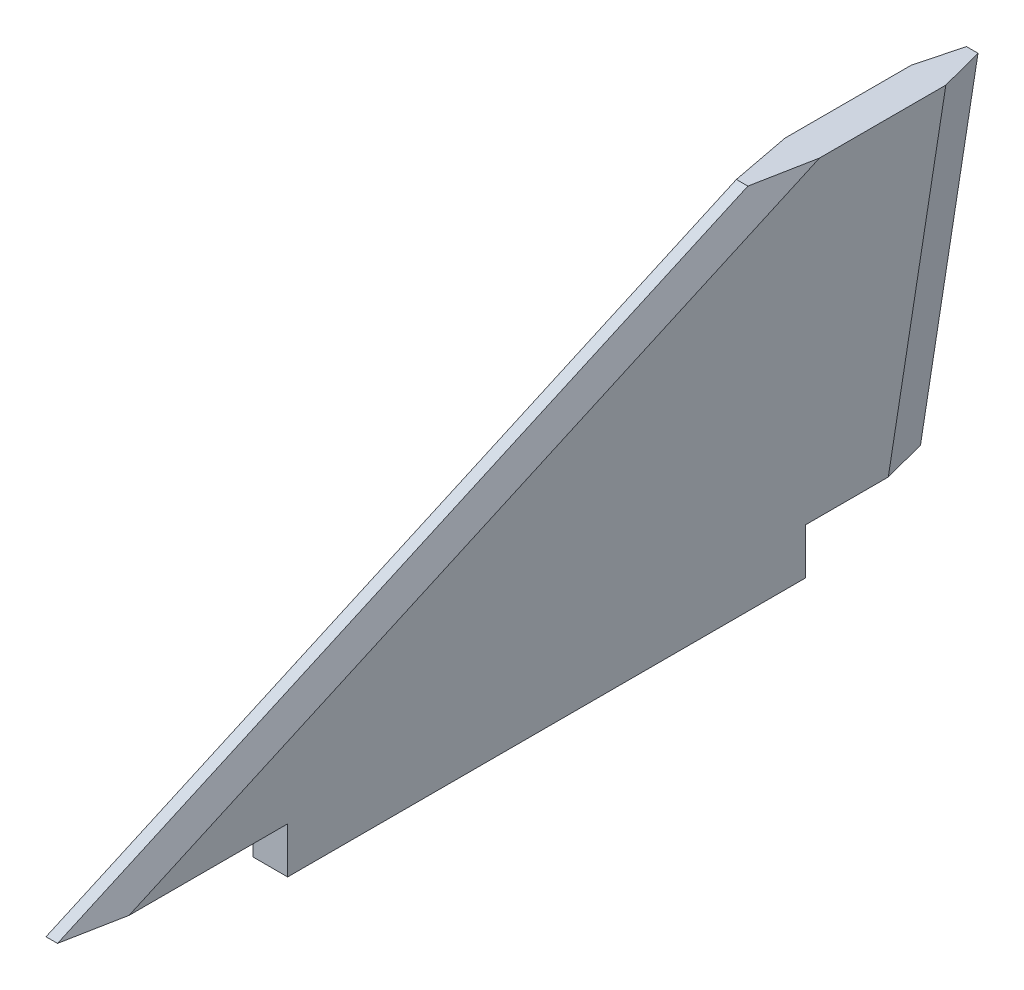
ISO-10303-21;
HEADER;
FILE_DESCRIPTION(('STEP AP214'),'2;1');
FILE_NAME('part.step','',(''),(''),'','','');
FILE_SCHEMA(('AUTOMOTIVE_DESIGN { 1 0 10303 214 1 1 1 1 }'));
ENDSEC;
DATA;
#1=APPLICATION_CONTEXT('core data for automotive mechanical design processes');
#2=APPLICATION_PROTOCOL_DEFINITION('international standard','automotive_design',2000,#1);
#3=PRODUCT_CONTEXT('',#1,'mechanical');
#4=PRODUCT('Part','Part','',(#3));
#5=PRODUCT_RELATED_PRODUCT_CATEGORY('part','',(#4));
#6=PRODUCT_DEFINITION_FORMATION('','',#4);
#7=PRODUCT_DEFINITION_CONTEXT('part definition',#1,'design');
#8=PRODUCT_DEFINITION('design','',#6,#7);
#9=PRODUCT_DEFINITION_SHAPE('','',#8);
#10=(LENGTH_UNIT() NAMED_UNIT(*) SI_UNIT(.MILLI.,.METRE.));
#11=(NAMED_UNIT(*) PLANE_ANGLE_UNIT() SI_UNIT($,.RADIAN.));
#12=(NAMED_UNIT(*) SI_UNIT($,.STERADIAN.) SOLID_ANGLE_UNIT());
#13=UNCERTAINTY_MEASURE_WITH_UNIT(LENGTH_MEASURE(1.E-05),#10,'distance_accuracy_value','');
#14=(GEOMETRIC_REPRESENTATION_CONTEXT(3) GLOBAL_UNCERTAINTY_ASSIGNED_CONTEXT((#13)) GLOBAL_UNIT_ASSIGNED_CONTEXT((#10,
#11,#12)) REPRESENTATION_CONTEXT('',''));
#15=CARTESIAN_POINT('',(0.,0.,0.));
#16=DIRECTION('',(0.,0.,1.));
#17=DIRECTION('',(1.,0.,0.));
#18=AXIS2_PLACEMENT_3D('',#15,#16,#17);
#19=CARTESIAN_POINT('',(1.5,0.,0.));
#20=DIRECTION('',(0.,-1.,0.));
#21=DIRECTION('',(0.,0.,-1.));
#22=AXIS2_PLACEMENT_3D('',#19,#20,#21);
#23=PLANE('',#22);
#24=DIRECTION('',(0.,0.,1.));
#25=VECTOR('',#24,1.);
#26=CARTESIAN_POINT('',(-1.5,0.,0.));
#27=LINE('',#26,#25);
#28=CARTESIAN_POINT('',(-1.5,0.,-45.));
#29=VERTEX_POINT('',#28);
#30=CARTESIAN_POINT('',(-1.5,0.,0.));
#31=VERTEX_POINT('',#30);
#32=EDGE_CURVE('E146',#29,#31,#27,.T.);
#33=ORIENTED_EDGE('',*,*,#32,.F.);
#34=DIRECTION('',(-1.,0.,0.));
#35=VECTOR('',#34,1.);
#36=CARTESIAN_POINT('',(1.5,0.,-45.));
#37=LINE('',#36,#35);
#38=CARTESIAN_POINT('',(1.5,0.,-45.));
#39=VERTEX_POINT('',#38);
#40=EDGE_CURVE('E141',#39,#29,#37,.T.);
#41=ORIENTED_EDGE('',*,*,#40,.F.);
#42=DIRECTION('',(0.,0.,1.));
#43=VECTOR('',#42,1.);
#44=CARTESIAN_POINT('',(1.5,0.,0.));
#45=LINE('',#44,#43);
#46=CARTESIAN_POINT('',(1.5,0.,0.));
#47=VERTEX_POINT('',#46);
#48=EDGE_CURVE('E143',#39,#47,#45,.T.);
#49=ORIENTED_EDGE('',*,*,#48,.T.);
#50=DIRECTION('',(-1.,0.,0.));
#51=VECTOR('',#50,1.);
#52=CARTESIAN_POINT('',(1.5,0.,0.));
#53=LINE('',#52,#51);
#54=EDGE_CURVE('E181',#47,#31,#53,.T.);
#55=ORIENTED_EDGE('',*,*,#54,.T.);
#56=EDGE_LOOP('',(#33,#41,#49,#55));
#57=FACE_BOUND('',#56,.T.);
#58=ADVANCED_FACE('F48',(#57),#23,.T.);
#59=CARTESIAN_POINT('',(1.5,0.,-45.));
#60=DIRECTION('',(0.,0.,-1.));
#61=DIRECTION('',(-1.,0.,0.));
#62=AXIS2_PLACEMENT_3D('',#59,#60,#61);
#63=PLANE('',#62);
#64=DIRECTION('',(0.,-1.,0.));
#65=VECTOR('',#64,1.);
#66=CARTESIAN_POINT('',(-1.5,0.,-45.));
#67=LINE('',#66,#65);
#68=CARTESIAN_POINT('',(-1.5,4.,-45.));
#69=VERTEX_POINT('',#68);
#70=EDGE_CURVE('E184',#69,#29,#67,.T.);
#71=ORIENTED_EDGE('',*,*,#70,.F.);
#72=DIRECTION('',(-1.,0.,0.));
#73=VECTOR('',#72,1.);
#74=CARTESIAN_POINT('',(1.5,4.,-45.));
#75=LINE('',#74,#73);
#76=CARTESIAN_POINT('',(1.5,4.,-45.));
#77=VERTEX_POINT('',#76);
#78=EDGE_CURVE('E153',#77,#69,#75,.T.);
#79=ORIENTED_EDGE('',*,*,#78,.F.);
#80=DIRECTION('',(0.,-1.,0.));
#81=VECTOR('',#80,1.);
#82=CARTESIAN_POINT('',(1.5,0.,-45.));
#83=LINE('',#82,#81);
#84=EDGE_CURVE('E158',#77,#39,#83,.T.);
#85=ORIENTED_EDGE('',*,*,#84,.T.);
#86=ORIENTED_EDGE('',*,*,#40,.T.);
#87=EDGE_LOOP('',(#71,#79,#85,#86));
#88=FACE_BOUND('',#87,.T.);
#89=ADVANCED_FACE('F165',(#88),#63,.T.);
#90=CARTESIAN_POINT('',(1.5,4.00000000000004,0.));
#91=DIRECTION('',(0.,-1.,0.));
#92=DIRECTION('',(0.,0.,-1.));
#93=AXIS2_PLACEMENT_3D('',#90,#91,#92);
#94=PLANE('',#93);
#95=DIRECTION('',(-1.,0.,0.));
#96=VECTOR('',#95,1.);
#97=CARTESIAN_POINT('',(1.5,3.99999999999999,-56.));
#98=LINE('',#97,#96);
#99=CARTESIAN_POINT('',(0.499999999999999,3.99999999999999,-56.));
#100=VERTEX_POINT('',#99);
#101=CARTESIAN_POINT('',(-0.499999999999998,3.99999999999999,-56.));
#102=VERTEX_POINT('',#101);
#103=EDGE_CURVE('E215',#100,#102,#98,.T.);
#104=ORIENTED_EDGE('',*,*,#103,.F.);
#105=DIRECTION('',(-0.254775202924953,0.,-0.967000308156388));
#106=VECTOR('',#105,1.);
#107=CARTESIAN_POINT('',(14.3615015894114,4.00000000000003,-3.38861492568621));
#108=LINE('',#107,#106);
#109=CARTESIAN_POINT('',(1.5,3.99999999999999,-52.2044959750607));
#110=VERTEX_POINT('',#109);
#111=EDGE_CURVE('E230',#100,#110,#108,.F.);
#112=ORIENTED_EDGE('',*,*,#111,.T.);
#113=DIRECTION('',(0.,0.,1.));
#114=VECTOR('',#113,1.);
#115=CARTESIAN_POINT('',(1.5,4.00000000000004,0.));
#116=LINE('',#115,#114);
#117=EDGE_CURVE('E168',#110,#77,#116,.T.);
#118=ORIENTED_EDGE('',*,*,#117,.T.);
#119=ORIENTED_EDGE('',*,*,#78,.T.);
#120=DIRECTION('',(0.,0.,1.));
#121=VECTOR('',#120,1.);
#122=CARTESIAN_POINT('',(-1.5,4.00000000000004,0.));
#123=LINE('',#122,#121);
#124=CARTESIAN_POINT('',(-1.5,3.99999999999999,-52.2044959750607));
#125=VERTEX_POINT('',#124);
#126=EDGE_CURVE('E187',#125,#69,#123,.T.);
#127=ORIENTED_EDGE('',*,*,#126,.F.);
#128=DIRECTION('',(0.254775202924953,0.,-0.967000308156388));
#129=VECTOR('',#128,1.);
#130=CARTESIAN_POINT('',(-14.1667703773351,4.00000000000003,-4.12771802490332));
#131=LINE('',#130,#129);
#132=EDGE_CURVE('E227',#125,#102,#131,.T.);
#133=ORIENTED_EDGE('',*,*,#132,.T.);
#134=EDGE_LOOP('',(#104,#112,#118,#119,#127,#133));
#135=FACE_BOUND('',#134,.T.);
#136=ADVANCED_FACE('F301',(#135),#94,.T.);
#137=CARTESIAN_POINT('',(1.5,-9.89389920424404,-53.4270557029178));
#138=DIRECTION('',(0.,-0.182089260182308,-0.98328200498446));
#139=DIRECTION('',(0.,0.98328200498446,-0.182089260182308));
#140=AXIS2_PLACEMENT_3D('',#137,#138,#139);
#141=PLANE('',#140);
#142=DIRECTION('',(-1.,0.,0.));
#143=VECTOR('',#142,1.);
#144=CARTESIAN_POINT('',(1.5,31.,-61.));
#145=LINE('',#144,#143);
#146=CARTESIAN_POINT('',(0.499999999999999,31.,-61.));
#147=VERTEX_POINT('',#146);
#148=CARTESIAN_POINT('',(-0.499999999999998,31.,-61.));
#149=VERTEX_POINT('',#148);
#150=EDGE_CURVE('E211',#147,#149,#145,.T.);
#151=ORIENTED_EDGE('',*,*,#150,.F.);
#152=DIRECTION('',(0.,-0.98328200498446,0.182089260182308));
#153=VECTOR('',#152,1.);
#154=CARTESIAN_POINT('',(0.499999999999999,-9.89389920424404,-53.4270557029178));
#155=LINE('',#154,#153);
#156=EDGE_CURVE('E223',#147,#100,#155,.T.);
#157=ORIENTED_EDGE('',*,*,#156,.T.);
#158=ORIENTED_EDGE('',*,*,#103,.T.);
#159=DIRECTION('',(0.,0.98328200498446,-0.182089260182308));
#160=VECTOR('',#159,1.);
#161=CARTESIAN_POINT('',(-0.499999999999998,31.,-61.));
#162=LINE('',#161,#160);
#163=EDGE_CURVE('E152',#102,#149,#162,.T.);
#164=ORIENTED_EDGE('',*,*,#163,.T.);
#165=EDGE_LOOP('',(#151,#157,#158,#164));
#166=FACE_BOUND('',#165,.T.);
#167=ADVANCED_FACE('F293',(#166),#141,.T.);
#168=CARTESIAN_POINT('',(1.5,31.,0.));
#169=DIRECTION('',(0.,1.,0.));
#170=DIRECTION('',(0.,0.,1.));
#171=AXIS2_PLACEMENT_3D('',#168,#169,#170);
#172=PLANE('',#171);
#173=DIRECTION('',(0.,0.,-1.));
#174=VECTOR('',#173,1.);
#175=CARTESIAN_POINT('',(-1.5,31.,0.));
#176=LINE('',#175,#174);
#177=CARTESIAN_POINT('',(-1.5,31.,-46.225856510041));
#178=VERTEX_POINT('',#177);
#179=CARTESIAN_POINT('',(-1.5,31.,-57.2044959750607));
#180=VERTEX_POINT('',#179);
#181=EDGE_CURVE('E190',#178,#180,#176,.T.);
#182=ORIENTED_EDGE('',*,*,#181,.F.);
#183=DIRECTION('',(0.187946098824648,0.,0.982179344079581));
#184=VECTOR('',#183,1.);
#185=CARTESIAN_POINT('',(7.13911529082907,31.,-1.07907962646776));
#186=LINE('',#185,#184);
#187=CARTESIAN_POINT('',(-0.499999999999992,31.,-41.));
#188=VERTEX_POINT('',#187);
#189=EDGE_CURVE('E255',#178,#188,#186,.T.);
#190=ORIENTED_EDGE('',*,*,#189,.T.);
#191=DIRECTION('',(-1.,0.,0.));
#192=VECTOR('',#191,1.);
#193=CARTESIAN_POINT('',(1.5,31.,-41.));
#194=LINE('',#193,#192);
#195=CARTESIAN_POINT('',(0.499999999999994,31.,-41.));
#196=VERTEX_POINT('',#195);
#197=EDGE_CURVE('E208',#196,#188,#194,.T.);
#198=ORIENTED_EDGE('',*,*,#197,.F.);
#199=DIRECTION('',(-0.187946098824648,0.,0.982179344079581));
#200=VECTOR('',#199,1.);
#201=CARTESIAN_POINT('',(-7.03314408263886,31.,-1.63286995466548));
#202=LINE('',#201,#200);
#203=CARTESIAN_POINT('',(1.5,31.,-46.225856510041));
#204=VERTEX_POINT('',#203);
#205=EDGE_CURVE('E252',#196,#204,#202,.F.);
#206=ORIENTED_EDGE('',*,*,#205,.T.);
#207=DIRECTION('',(0.,0.,-1.));
#208=VECTOR('',#207,1.);
#209=CARTESIAN_POINT('',(1.5,31.,0.));
#210=LINE('',#209,#208);
#211=CARTESIAN_POINT('',(1.5,31.,-57.2044959750607));
#212=VERTEX_POINT('',#211);
#213=EDGE_CURVE('E171',#204,#212,#210,.T.);
#214=ORIENTED_EDGE('',*,*,#213,.T.);
#215=DIRECTION('',(0.254775202924953,0.,0.967000308156388));
#216=VECTOR('',#215,1.);
#217=CARTESIAN_POINT('',(15.5933400881066,31.,-3.71316694581346));
#218=LINE('',#217,#216);
#219=EDGE_CURVE('E241',#212,#147,#218,.F.);
#220=ORIENTED_EDGE('',*,*,#219,.T.);
#221=ORIENTED_EDGE('',*,*,#150,.T.);
#222=DIRECTION('',(-0.254775202924953,0.,0.967000308156388));
#223=VECTOR('',#222,1.);
#224=CARTESIAN_POINT('',(-15.3986088760303,31.,-4.45227004503057));
#225=LINE('',#224,#223);
#226=EDGE_CURVE('E237',#149,#180,#225,.T.);
#227=ORIENTED_EDGE('',*,*,#226,.T.);
#228=EDGE_LOOP('',(#182,#190,#198,#206,#214,#220,#221,#227));
#229=FACE_BOUND('',#228,.T.);
#230=ADVANCED_FACE('F280',(#229),#172,.T.);
#231=CARTESIAN_POINT('',(1.5,10.4365904365904,4.6964656964657));
#232=DIRECTION('',(0.,0.911921505175106,0.410364677328798));
#233=DIRECTION('',(0.,-0.410364677328798,0.911921505175107));
#234=AXIS2_PLACEMENT_3D('',#231,#232,#233);
#235=PLANE('',#234);
#236=ORIENTED_EDGE('',*,*,#197,.T.);
#237=DIRECTION('',(0.,-0.410364677328798,0.911921505175107));
#238=VECTOR('',#237,1.);
#239=CARTESIAN_POINT('',(-0.499999999999992,3.99999999999999,19.));
#240=LINE('',#239,#238);
#241=CARTESIAN_POINT('',(-0.499999999999992,3.99999999999999,19.));
#242=VERTEX_POINT('',#241);
#243=EDGE_CURVE('E71',#188,#242,#240,.T.);
#244=ORIENTED_EDGE('',*,*,#243,.T.);
#245=DIRECTION('',(-1.,0.,0.));
#246=VECTOR('',#245,1.);
#247=CARTESIAN_POINT('',(1.5,3.99999999999999,19.));
#248=LINE('',#247,#246);
#249=CARTESIAN_POINT('',(0.499999999999994,3.99999999999999,19.));
#250=VERTEX_POINT('',#249);
#251=EDGE_CURVE('E205',#250,#242,#248,.T.);
#252=ORIENTED_EDGE('',*,*,#251,.F.);
#253=DIRECTION('',(0.,0.410364677328798,-0.911921505175107));
#254=VECTOR('',#253,1.);
#255=CARTESIAN_POINT('',(0.499999999999994,10.4365904365904,4.6964656964657));
#256=LINE('',#255,#254);
#257=EDGE_CURVE('E258',#250,#196,#256,.T.);
#258=ORIENTED_EDGE('',*,*,#257,.T.);
#259=EDGE_LOOP('',(#236,#244,#252,#258));
#260=FACE_BOUND('',#259,.T.);
#261=ADVANCED_FACE('F281',(#260),#235,.T.);
#262=CARTESIAN_POINT('',(1.5,4.,0.));
#263=DIRECTION('',(0.,-1.,0.));
#264=DIRECTION('',(0.,0.,-1.));
#265=AXIS2_PLACEMENT_3D('',#262,#263,#264);
#266=PLANE('',#265);
#267=ORIENTED_EDGE('',*,*,#251,.T.);
#268=DIRECTION('',(-0.187946098824648,0.,-0.982179344079581));
#269=VECTOR('',#268,1.);
#270=CARTESIAN_POINT('',(-3.93669127312545,4.,1.0403445373365));
#271=LINE('',#270,#269);
#272=CARTESIAN_POINT('',(-1.5,3.99999999999999,13.774143489959));
#273=VERTEX_POINT('',#272);
#274=EDGE_CURVE('E58',#242,#273,#271,.T.);
#275=ORIENTED_EDGE('',*,*,#274,.T.);
#276=DIRECTION('',(0.,0.,1.));
#277=VECTOR('',#276,1.);
#278=CARTESIAN_POINT('',(-1.5,4.,0.));
#279=LINE('',#278,#277);
#280=CARTESIAN_POINT('',(-1.5,4.,0.));
#281=VERTEX_POINT('',#280);
#282=EDGE_CURVE('E193',#281,#273,#279,.T.);
#283=ORIENTED_EDGE('',*,*,#282,.F.);
#284=DIRECTION('',(-1.,0.,0.));
#285=VECTOR('',#284,1.);
#286=CARTESIAN_POINT('',(1.5,4.,0.));
#287=LINE('',#286,#285);
#288=CARTESIAN_POINT('',(1.5,4.,0.));
#289=VERTEX_POINT('',#288);
#290=EDGE_CURVE('E202',#289,#281,#287,.T.);
#291=ORIENTED_EDGE('',*,*,#290,.F.);
#292=DIRECTION('',(0.,0.,1.));
#293=VECTOR('',#292,1.);
#294=CARTESIAN_POINT('',(1.5,4.,0.));
#295=LINE('',#294,#293);
#296=CARTESIAN_POINT('',(1.5,3.99999999999999,13.774143489959));
#297=VERTEX_POINT('',#296);
#298=EDGE_CURVE('E176',#289,#297,#295,.T.);
#299=ORIENTED_EDGE('',*,*,#298,.T.);
#300=DIRECTION('',(0.187946098824648,0.,-0.982179344079581));
#301=VECTOR('',#300,1.);
#302=CARTESIAN_POINT('',(4.04266248131566,4.,0.486554209138771));
#303=LINE('',#302,#301);
#304=EDGE_CURVE('E264',#297,#250,#303,.F.);
#305=ORIENTED_EDGE('',*,*,#304,.T.);
#306=EDGE_LOOP('',(#267,#275,#283,#291,#299,#305));
#307=FACE_BOUND('',#306,.T.);
#308=ADVANCED_FACE('F270',(#307),#266,.T.);
#309=CARTESIAN_POINT('',(1.5,0.,0.));
#310=DIRECTION('',(0.,0.,1.));
#311=DIRECTION('',(1.,0.,0.));
#312=AXIS2_PLACEMENT_3D('',#309,#310,#311);
#313=PLANE('',#312);
#314=DIRECTION('',(0.,1.,0.));
#315=VECTOR('',#314,1.);
#316=CARTESIAN_POINT('',(-1.5,0.,0.));
#317=LINE('',#316,#315);
#318=EDGE_CURVE('E162',#31,#281,#317,.T.);
#319=ORIENTED_EDGE('',*,*,#318,.F.);
#320=ORIENTED_EDGE('',*,*,#54,.F.);
#321=DIRECTION('',(0.,1.,0.));
#322=VECTOR('',#321,1.);
#323=CARTESIAN_POINT('',(1.5,0.,0.));
#324=LINE('',#323,#322);
#325=EDGE_CURVE('E160',#47,#289,#324,.T.);
#326=ORIENTED_EDGE('',*,*,#325,.T.);
#327=ORIENTED_EDGE('',*,*,#290,.T.);
#328=EDGE_LOOP('',(#319,#320,#326,#327));
#329=FACE_BOUND('',#328,.T.);
#330=ADVANCED_FACE('F303',(#329),#313,.T.);
#331=CARTESIAN_POINT('',(1.5,0.,0.));
#332=DIRECTION('',(1.,0.,0.));
#333=DIRECTION('',(0.,0.,-1.));
#334=AXIS2_PLACEMENT_3D('',#331,#332,#333);
#335=PLANE('',#334);
#336=ORIENTED_EDGE('',*,*,#213,.F.);
#337=DIRECTION('',(0.,-0.410364677328798,0.911921505175107));
#338=VECTOR('',#337,1.);
#339=CARTESIAN_POINT('',(1.5,8.48096845778092,3.81643580600141));
#340=LINE('',#339,#338);
#341=EDGE_CURVE('E11',#204,#297,#340,.T.);
#342=ORIENTED_EDGE('',*,*,#341,.T.);
#343=ORIENTED_EDGE('',*,*,#298,.F.);
#344=ORIENTED_EDGE('',*,*,#325,.F.);
#345=ORIENTED_EDGE('',*,*,#48,.F.);
#346=ORIENTED_EDGE('',*,*,#84,.F.);
#347=ORIENTED_EDGE('',*,*,#117,.F.);
#348=DIRECTION('',(0.,0.98328200498446,-0.182089260182308));
#349=VECTOR('',#348,1.);
#350=CARTESIAN_POINT('',(1.5,-9.21433283373103,-49.7573973021475));
#351=LINE('',#350,#349);
#352=EDGE_CURVE('E233',#110,#212,#351,.T.);
#353=ORIENTED_EDGE('',*,*,#352,.T.);
#354=EDGE_LOOP('',(#336,#342,#343,#344,#345,#346,#347,#353));
#355=FACE_BOUND('',#354,.T.);
#356=ADVANCED_FACE('F156',(#355),#335,.T.);
#357=CARTESIAN_POINT('',(-1.5,0.,0.));
#358=DIRECTION('',(1.,0.,0.));
#359=DIRECTION('',(0.,0.,-1.));
#360=AXIS2_PLACEMENT_3D('',#357,#358,#359);
#361=PLANE('',#360);
#362=ORIENTED_EDGE('',*,*,#282,.T.);
#363=DIRECTION('',(0.,0.410364677328798,-0.911921505175107));
#364=VECTOR('',#363,1.);
#365=CARTESIAN_POINT('',(-1.5,29.0443780211905,-41.8800298904643));
#366=LINE('',#365,#364);
#367=EDGE_CURVE('E248',#273,#178,#366,.T.);
#368=ORIENTED_EDGE('',*,*,#367,.T.);
#369=ORIENTED_EDGE('',*,*,#181,.T.);
#370=DIRECTION('',(0.,-0.98328200498446,0.182089260182308));
#371=VECTOR('',#370,1.);
#372=CARTESIAN_POINT('',(-1.5,4.679566370513,-52.3303415992298));
#373=LINE('',#372,#371);
#374=EDGE_CURVE('E244',#180,#125,#373,.T.);
#375=ORIENTED_EDGE('',*,*,#374,.T.);
#376=ORIENTED_EDGE('',*,*,#126,.T.);
#377=ORIENTED_EDGE('',*,*,#70,.T.);
#378=ORIENTED_EDGE('',*,*,#32,.T.);
#379=ORIENTED_EDGE('',*,*,#318,.T.);
#380=EDGE_LOOP('',(#362,#368,#369,#375,#376,#377,#378,#379));
#381=FACE_BOUND('',#380,.T.);
#382=ADVANCED_FACE('F274',(#381),#361,.F.);
#383=CARTESIAN_POINT('',(0.499999999999999,-9.89389920424404,-53.4270557029178));
#384=DIRECTION('',(-0.965925826289069,0.0471281684438088,0.254492109596567));
#385=DIRECTION('',(0.,-0.98328200498446,0.182089260182308));
#386=AXIS2_PLACEMENT_3D('',#383,#384,#385);
#387=PLANE('',#386);
#388=ORIENTED_EDGE('',*,*,#219,.F.);
#389=ORIENTED_EDGE('',*,*,#352,.F.);
#390=ORIENTED_EDGE('',*,*,#111,.F.);
#391=ORIENTED_EDGE('',*,*,#156,.F.);
#392=EDGE_LOOP('',(#388,#389,#390,#391));
#393=FACE_BOUND('',#392,.T.);
#394=ADVANCED_FACE('F289',(#393),#387,.F.);
#395=CARTESIAN_POINT('',(-1.5,-9.21433283373103,-49.7573973021475));
#396=DIRECTION('',(-0.965925826289069,-0.0471281684438088,-0.254492109596567));
#397=DIRECTION('',(0.,0.98328200498446,-0.182089260182308));
#398=AXIS2_PLACEMENT_3D('',#395,#396,#397);
#399=PLANE('',#398);
#400=ORIENTED_EDGE('',*,*,#226,.F.);
#401=ORIENTED_EDGE('',*,*,#163,.F.);
#402=ORIENTED_EDGE('',*,*,#132,.F.);
#403=ORIENTED_EDGE('',*,*,#374,.F.);
#404=EDGE_LOOP('',(#400,#401,#402,#403));
#405=FACE_BOUND('',#404,.T.);
#406=ADVANCED_FACE('F297',(#405),#399,.T.);
#407=CARTESIAN_POINT('',(-1.5,8.48096845778092,3.81643580600141));
#408=DIRECTION('',(-0.906307787036649,0.385394681361068,0.173427606612481));
#409=DIRECTION('',(0.,-0.410364677328798,0.911921505175107));
#410=AXIS2_PLACEMENT_3D('',#407,#408,#409);
#411=PLANE('',#410);
#412=ORIENTED_EDGE('',*,*,#274,.F.);
#413=ORIENTED_EDGE('',*,*,#243,.F.);
#414=ORIENTED_EDGE('',*,*,#189,.F.);
#415=ORIENTED_EDGE('',*,*,#367,.F.);
#416=EDGE_LOOP('',(#412,#413,#414,#415));
#417=FACE_BOUND('',#416,.T.);
#418=ADVANCED_FACE('F277',(#417),#411,.T.);
#419=CARTESIAN_POINT('',(0.499999999999992,10.4365904365904,4.6964656964657));
#420=DIRECTION('',(-0.906307787036649,-0.385394681361068,-0.173427606612481));
#421=DIRECTION('',(0.,0.410364677328798,-0.911921505175107));
#422=AXIS2_PLACEMENT_3D('',#419,#420,#421);
#423=PLANE('',#422);
#424=ORIENTED_EDGE('',*,*,#304,.F.);
#425=ORIENTED_EDGE('',*,*,#341,.F.);
#426=ORIENTED_EDGE('',*,*,#205,.F.);
#427=ORIENTED_EDGE('',*,*,#257,.F.);
#428=EDGE_LOOP('',(#424,#425,#426,#427));
#429=FACE_BOUND('',#428,.T.);
#430=ADVANCED_FACE('F51',(#429),#423,.F.);
#431=CLOSED_SHELL('',(#58,#89,#136,#167,#230,#261,#308,#330,#356,#382,#394,#406,#418,#430));
#432=MANIFOLD_SOLID_BREP('B2',#431);
#433=ADVANCED_BREP_SHAPE_REPRESENTATION('',(#18,#432),#14);
#434=SHAPE_DEFINITION_REPRESENTATION(#9,#433);
ENDSEC;
END-ISO-10303-21;
